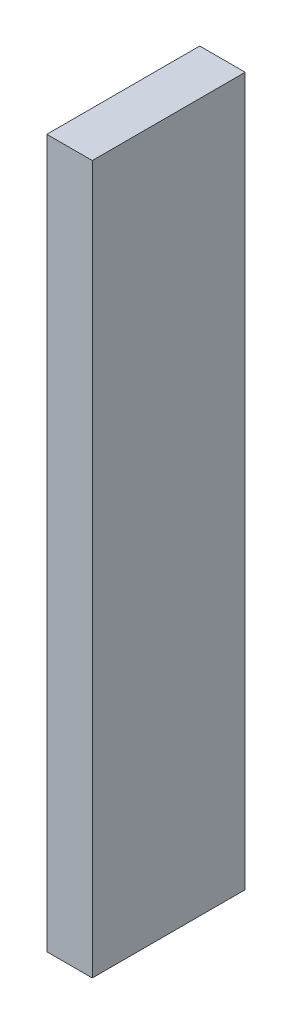
ISO-10303-21;
HEADER;
FILE_DESCRIPTION(('STEP AP214'),'2;1');
FILE_NAME('part.step','',(''),(''),'','','');
FILE_SCHEMA(('AUTOMOTIVE_DESIGN { 1 0 10303 214 1 1 1 1 }'));
ENDSEC;
DATA;
#1=APPLICATION_CONTEXT('core data for automotive mechanical design processes');
#2=APPLICATION_PROTOCOL_DEFINITION('international standard','automotive_design',2000,#1);
#3=PRODUCT_CONTEXT('',#1,'mechanical');
#4=PRODUCT('Part','Part','',(#3));
#5=PRODUCT_RELATED_PRODUCT_CATEGORY('part','',(#4));
#6=PRODUCT_DEFINITION_FORMATION('','',#4);
#7=PRODUCT_DEFINITION_CONTEXT('part definition',#1,'design');
#8=PRODUCT_DEFINITION('design','',#6,#7);
#9=PRODUCT_DEFINITION_SHAPE('','',#8);
#10=(LENGTH_UNIT() NAMED_UNIT(*) SI_UNIT(.MILLI.,.METRE.));
#11=(NAMED_UNIT(*) PLANE_ANGLE_UNIT() SI_UNIT($,.RADIAN.));
#12=(NAMED_UNIT(*) SI_UNIT($,.STERADIAN.) SOLID_ANGLE_UNIT());
#13=UNCERTAINTY_MEASURE_WITH_UNIT(LENGTH_MEASURE(1.E-05),#10,'distance_accuracy_value','');
#14=(GEOMETRIC_REPRESENTATION_CONTEXT(3) GLOBAL_UNCERTAINTY_ASSIGNED_CONTEXT((#13)) GLOBAL_UNIT_ASSIGNED_CONTEXT((#10,
#11,#12)) REPRESENTATION_CONTEXT('',''));
#15=CARTESIAN_POINT('',(0.,0.,0.));
#16=DIRECTION('',(0.,0.,1.));
#17=DIRECTION('',(1.,0.,0.));
#18=AXIS2_PLACEMENT_3D('',#15,#16,#17);
#19=CARTESIAN_POINT('',(130.275545212479,22.4180708263693,86.072028202897));
#20=DIRECTION('',(-1.69244514382854E-09,0.,1.));
#21=DIRECTION('',(1.,0.,1.69244514382854E-09));
#22=AXIS2_PLACEMENT_3D('',#19,#20,#21);
#23=PLANE('',#22);
#24=DIRECTION('',(0.,-1.,0.));
#25=VECTOR('',#24,1.);
#26=CARTESIAN_POINT('',(131.258630309492,22.4180708263693,86.0720282045608));
#27=LINE('',#26,#25);
#28=CARTESIAN_POINT('',(131.258630309492,22.4180708263693,86.0720282045608));
#29=VERTEX_POINT('',#28);
#30=CARTESIAN_POINT('',(131.258630309492,7.11212965552236,86.0720282045608));
#31=VERTEX_POINT('',#30);
#32=EDGE_CURVE('E79',#29,#31,#27,.T.);
#33=ORIENTED_EDGE('',*,*,#32,.F.);
#34=DIRECTION('',(1.,0.,1.69244514382854E-09));
#35=VECTOR('',#34,1.);
#36=CARTESIAN_POINT('',(130.275545212479,22.4180708263693,86.072028202897));
#37=LINE('',#36,#35);
#38=CARTESIAN_POINT('',(130.275545212479,22.4180708263693,86.072028202897));
#39=VERTEX_POINT('',#38);
#40=EDGE_CURVE('E32',#39,#29,#37,.T.);
#41=ORIENTED_EDGE('',*,*,#40,.F.);
#42=DIRECTION('',(0.,-1.,0.));
#43=VECTOR('',#42,1.);
#44=CARTESIAN_POINT('',(130.275545212479,22.4180708263693,86.072028202897));
#45=LINE('',#44,#43);
#46=CARTESIAN_POINT('',(130.275545212479,7.11212965552236,86.072028202897));
#47=VERTEX_POINT('',#46);
#48=EDGE_CURVE('E71',#39,#47,#45,.T.);
#49=ORIENTED_EDGE('',*,*,#48,.T.);
#50=DIRECTION('',(1.,0.,1.69244514382854E-09));
#51=VECTOR('',#50,1.);
#52=CARTESIAN_POINT('',(130.275545212479,7.11212965552236,86.072028202897));
#53=LINE('',#52,#51);
#54=EDGE_CURVE('E10',#47,#31,#53,.T.);
#55=ORIENTED_EDGE('',*,*,#54,.T.);
#56=EDGE_LOOP('',(#33,#41,#49,#55));
#57=FACE_BOUND('',#56,.T.);
#58=ADVANCED_FACE('F16',(#57),#23,.T.);
#59=CARTESIAN_POINT('',(130.275545212479,7.11212965552236,86.072028202897));
#60=DIRECTION('',(0.,-1.,0.));
#61=DIRECTION('',(0.,0.,-1.));
#62=AXIS2_PLACEMENT_3D('',#59,#60,#61);
#63=PLANE('',#62);
#64=DIRECTION('',(1.69244514382854E-09,0.,-1.));
#65=VECTOR('',#64,1.);
#66=CARTESIAN_POINT('',(131.258630309492,7.11212965552236,86.0720282045608));
#67=LINE('',#66,#65);
#68=CARTESIAN_POINT('',(131.258630315087,7.11212965552235,82.766087033712));
#69=VERTEX_POINT('',#68);
#70=EDGE_CURVE('E82',#31,#69,#67,.T.);
#71=ORIENTED_EDGE('',*,*,#70,.F.);
#72=ORIENTED_EDGE('',*,*,#54,.F.);
#73=DIRECTION('',(1.69244514382854E-09,0.,-1.));
#74=VECTOR('',#73,1.);
#75=CARTESIAN_POINT('',(130.275545212479,7.11212965552236,86.072028202897));
#76=LINE('',#75,#74);
#77=CARTESIAN_POINT('',(130.275545218074,7.11212965552235,82.7660870320482));
#78=VERTEX_POINT('',#77);
#79=EDGE_CURVE('E67',#47,#78,#76,.T.);
#80=ORIENTED_EDGE('',*,*,#79,.T.);
#81=DIRECTION('',(1.,0.,1.69244514382854E-09));
#82=VECTOR('',#81,1.);
#83=CARTESIAN_POINT('',(130.275545218074,7.11212965552235,82.7660870320482));
#84=LINE('',#83,#82);
#85=EDGE_CURVE('E24',#78,#69,#84,.T.);
#86=ORIENTED_EDGE('',*,*,#85,.T.);
#87=EDGE_LOOP('',(#71,#72,#80,#86));
#88=FACE_BOUND('',#87,.T.);
#89=ADVANCED_FACE('F68',(#88),#63,.T.);
#90=CARTESIAN_POINT('',(130.275545218074,7.11212965552235,82.7660870320482));
#91=DIRECTION('',(1.69244514382854E-09,0.,-1.));
#92=DIRECTION('',(-1.,0.,-1.69244514382854E-09));
#93=AXIS2_PLACEMENT_3D('',#90,#91,#92);
#94=PLANE('',#93);
#95=DIRECTION('',(0.,1.,0.));
#96=VECTOR('',#95,1.);
#97=CARTESIAN_POINT('',(131.258630315087,7.11212965552235,82.766087033712));
#98=LINE('',#97,#96);
#99=CARTESIAN_POINT('',(131.258630315087,22.418070826371,82.7660870252515));
#100=VERTEX_POINT('',#99);
#101=EDGE_CURVE('E65',#69,#100,#98,.T.);
#102=ORIENTED_EDGE('',*,*,#101,.F.);
#103=ORIENTED_EDGE('',*,*,#85,.F.);
#104=DIRECTION('',(0.,1.,0.));
#105=VECTOR('',#104,1.);
#106=CARTESIAN_POINT('',(130.275545218074,7.11212965552235,82.7660870320482));
#107=LINE('',#106,#105);
#108=CARTESIAN_POINT('',(130.275545218074,22.418070826371,82.7660870235877));
#109=VERTEX_POINT('',#108);
#110=EDGE_CURVE('E62',#78,#109,#107,.T.);
#111=ORIENTED_EDGE('',*,*,#110,.T.);
#112=DIRECTION('',(1.,0.,1.69244514382854E-09));
#113=VECTOR('',#112,1.);
#114=CARTESIAN_POINT('',(130.275545218074,22.418070826371,82.7660870235877));
#115=LINE('',#114,#113);
#116=EDGE_CURVE('E48',#109,#100,#115,.T.);
#117=ORIENTED_EDGE('',*,*,#116,.T.);
#118=EDGE_LOOP('',(#102,#103,#111,#117));
#119=FACE_BOUND('',#118,.T.);
#120=ADVANCED_FACE('F60',(#119),#94,.T.);
#121=CARTESIAN_POINT('',(130.275545218074,22.418070826371,82.7660870235877));
#122=DIRECTION('',(0.,1.,0.));
#123=DIRECTION('',(-1.,0.,0.));
#124=AXIS2_PLACEMENT_3D('',#121,#122,#123);
#125=PLANE('',#124);
#126=DIRECTION('',(-1.69244514382854E-09,0.,1.));
#127=VECTOR('',#126,1.);
#128=CARTESIAN_POINT('',(131.258630315087,22.418070826371,82.7660870252515));
#129=LINE('',#128,#127);
#130=EDGE_CURVE('E85',#100,#29,#129,.T.);
#131=ORIENTED_EDGE('',*,*,#130,.F.);
#132=ORIENTED_EDGE('',*,*,#116,.F.);
#133=DIRECTION('',(-1.69244514382854E-09,0.,1.));
#134=VECTOR('',#133,1.);
#135=CARTESIAN_POINT('',(130.275545218074,22.418070826371,82.7660870235877));
#136=LINE('',#135,#134);
#137=EDGE_CURVE('E74',#109,#39,#136,.T.);
#138=ORIENTED_EDGE('',*,*,#137,.T.);
#139=ORIENTED_EDGE('',*,*,#40,.T.);
#140=EDGE_LOOP('',(#131,#132,#138,#139));
#141=FACE_BOUND('',#140,.T.);
#142=ADVANCED_FACE('F96',(#141),#125,.T.);
#143=CARTESIAN_POINT('',(130.275545201028,17.2651002409467,92.8378644340291));
#144=DIRECTION('',(1.,0.,1.69244514382854E-09));
#145=DIRECTION('',(0.,1.,0.));
#146=AXIS2_PLACEMENT_3D('',#143,#144,#145);
#147=PLANE('',#146);
#148=ORIENTED_EDGE('',*,*,#48,.F.);
#149=ORIENTED_EDGE('',*,*,#137,.F.);
#150=ORIENTED_EDGE('',*,*,#110,.F.);
#151=ORIENTED_EDGE('',*,*,#79,.F.);
#152=EDGE_LOOP('',(#148,#149,#150,#151));
#153=FACE_BOUND('',#152,.T.);
#154=ADVANCED_FACE('F73',(#153),#147,.F.);
#155=CARTESIAN_POINT('',(131.258630298041,17.2651002409467,92.8378644356929));
#156=DIRECTION('',(1.,0.,1.69244514382854E-09));
#157=DIRECTION('',(0.,1.,0.));
#158=AXIS2_PLACEMENT_3D('',#155,#156,#157);
#159=PLANE('',#158);
#160=ORIENTED_EDGE('',*,*,#32,.T.);
#161=ORIENTED_EDGE('',*,*,#70,.T.);
#162=ORIENTED_EDGE('',*,*,#101,.T.);
#163=ORIENTED_EDGE('',*,*,#130,.T.);
#164=EDGE_LOOP('',(#160,#161,#162,#163));
#165=FACE_BOUND('',#164,.T.);
#166=ADVANCED_FACE('F89',(#165),#159,.T.);
#167=CLOSED_SHELL('',(#58,#89,#120,#142,#154,#166));
#168=MANIFOLD_SOLID_BREP('B1',#167);
#169=ADVANCED_BREP_SHAPE_REPRESENTATION('',(#18,#168),#14);
#170=SHAPE_DEFINITION_REPRESENTATION(#9,#169);
ENDSEC;
END-ISO-10303-21;
